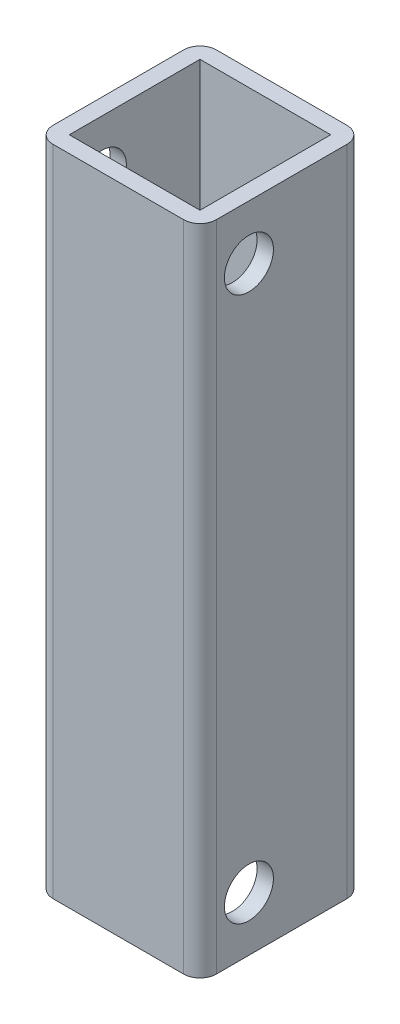
ISO-10303-21;
HEADER;
FILE_DESCRIPTION(('STEP AP214'),'2;1');
FILE_NAME('part.step','',(''),(''),'','','');
FILE_SCHEMA(('AUTOMOTIVE_DESIGN { 1 0 10303 214 1 1 1 1 }'));
ENDSEC;
DATA;
#1=APPLICATION_CONTEXT('core data for automotive mechanical design processes');
#2=APPLICATION_PROTOCOL_DEFINITION('international standard','automotive_design',2000,#1);
#3=PRODUCT_CONTEXT('',#1,'mechanical');
#4=PRODUCT('Part','Part','',(#3));
#5=PRODUCT_RELATED_PRODUCT_CATEGORY('part','',(#4));
#6=PRODUCT_DEFINITION_FORMATION('','',#4);
#7=PRODUCT_DEFINITION_CONTEXT('part definition',#1,'design');
#8=PRODUCT_DEFINITION('design','',#6,#7);
#9=PRODUCT_DEFINITION_SHAPE('','',#8);
#10=(LENGTH_UNIT() NAMED_UNIT(*) SI_UNIT(.MILLI.,.METRE.));
#11=(NAMED_UNIT(*) PLANE_ANGLE_UNIT() SI_UNIT($,.RADIAN.));
#12=(NAMED_UNIT(*) SI_UNIT($,.STERADIAN.) SOLID_ANGLE_UNIT());
#13=UNCERTAINTY_MEASURE_WITH_UNIT(LENGTH_MEASURE(1.E-05),#10,'distance_accuracy_value','');
#14=(GEOMETRIC_REPRESENTATION_CONTEXT(3) GLOBAL_UNCERTAINTY_ASSIGNED_CONTEXT((#13)) GLOBAL_UNIT_ASSIGNED_CONTEXT((#10,
#11,#12)) REPRESENTATION_CONTEXT('',''));
#15=CARTESIAN_POINT('',(0.,0.,0.));
#16=DIRECTION('',(0.,0.,1.));
#17=DIRECTION('',(1.,0.,0.));
#18=AXIS2_PLACEMENT_3D('',#15,#16,#17);
#19=CARTESIAN_POINT('',(-15.,497.934499999996,-29.1000000000432));
#20=DIRECTION('',(1.,0.,0.));
#21=DIRECTION('',(0.,0.,-1.));
#22=AXIS2_PLACEMENT_3D('',#19,#20,#21);
#23=CYLINDRICAL_SURFACE('',#22,4.50000000000003);
#24=CARTESIAN_POINT('',(12.,497.934499999996,-29.1000000000432));
#25=DIRECTION('',(1.,0.,0.));
#26=DIRECTION('',(0.,0.,-1.));
#27=AXIS2_PLACEMENT_3D('',#24,#25,#26);
#28=CIRCLE('',#27,4.50000000000003);
#29=CARTESIAN_POINT('',(12.,497.934499999996,-33.6000000000432));
#30=VERTEX_POINT('',#29);
#31=EDGE_CURVE('E140',#30,#30,#28,.F.);
#32=ORIENTED_EDGE('',*,*,#31,.T.);
#33=EDGE_LOOP('',(#32));
#34=FACE_BOUND('',#33,.T.);
#35=CARTESIAN_POINT('',(15.,497.934499999996,-29.1000000000432));
#36=DIRECTION('',(1.,0.,0.));
#37=DIRECTION('',(0.,0.,-1.));
#38=AXIS2_PLACEMENT_3D('',#35,#36,#37);
#39=CIRCLE('',#38,4.50000000000003);
#40=CARTESIAN_POINT('',(15.,497.934499999996,-33.6000000000432));
#41=VERTEX_POINT('',#40);
#42=EDGE_CURVE('E155',#41,#41,#39,.F.);
#43=ORIENTED_EDGE('',*,*,#42,.F.);
#44=EDGE_LOOP('',(#43));
#45=FACE_BOUND('',#44,.T.);
#46=ADVANCED_FACE('F17',(#34,#45),#23,.F.);
#47=CARTESIAN_POINT('',(-15.,397.934499999996,-29.1000000000331));
#48=DIRECTION('',(1.,0.,0.));
#49=DIRECTION('',(0.,0.,-1.));
#50=AXIS2_PLACEMENT_3D('',#47,#48,#49);
#51=CYLINDRICAL_SURFACE('',#50,4.50000000000003);
#52=CARTESIAN_POINT('',(12.,397.934499999996,-29.1000000000331));
#53=DIRECTION('',(1.,0.,0.));
#54=DIRECTION('',(0.,0.,-1.));
#55=AXIS2_PLACEMENT_3D('',#52,#53,#54);
#56=CIRCLE('',#55,4.50000000000003);
#57=CARTESIAN_POINT('',(12.,397.934499999996,-33.6000000000331));
#58=VERTEX_POINT('',#57);
#59=EDGE_CURVE('E126',#58,#58,#56,.F.);
#60=ORIENTED_EDGE('',*,*,#59,.T.);
#61=EDGE_LOOP('',(#60));
#62=FACE_BOUND('',#61,.T.);
#63=CARTESIAN_POINT('',(15.,397.934499999996,-29.1000000000331));
#64=DIRECTION('',(1.,0.,0.));
#65=DIRECTION('',(0.,0.,-1.));
#66=AXIS2_PLACEMENT_3D('',#63,#64,#65);
#67=CIRCLE('',#66,4.50000000000003);
#68=CARTESIAN_POINT('',(15.,397.934499999996,-33.6000000000331));
#69=VERTEX_POINT('',#68);
#70=EDGE_CURVE('E20',#69,#69,#67,.F.);
#71=ORIENTED_EDGE('',*,*,#70,.F.);
#72=EDGE_LOOP('',(#71));
#73=FACE_BOUND('',#72,.T.);
#74=ADVANCED_FACE('F197',(#62,#73),#51,.F.);
#75=CARTESIAN_POINT('',(-15.,397.934499999996,-29.1000000000331));
#76=DIRECTION('',(1.,0.,0.));
#77=DIRECTION('',(0.,0.,-1.));
#78=AXIS2_PLACEMENT_3D('',#75,#76,#77);
#79=CYLINDRICAL_SURFACE('',#78,4.50000000000003);
#80=CARTESIAN_POINT('',(-15.,397.934499999996,-29.1000000000331));
#81=DIRECTION('',(1.,0.,0.));
#82=DIRECTION('',(0.,0.,-1.));
#83=AXIS2_PLACEMENT_3D('',#80,#81,#82);
#84=CIRCLE('',#83,4.50000000000003);
#85=CARTESIAN_POINT('',(-15.,397.934499999996,-33.6000000000331));
#86=VERTEX_POINT('',#85);
#87=EDGE_CURVE('E149',#86,#86,#84,.T.);
#88=ORIENTED_EDGE('',*,*,#87,.F.);
#89=EDGE_LOOP('',(#88));
#90=FACE_BOUND('',#89,.T.);
#91=CARTESIAN_POINT('',(-12.,397.934499999996,-29.1000000000331));
#92=DIRECTION('',(1.,0.,0.));
#93=DIRECTION('',(0.,0.,-1.));
#94=AXIS2_PLACEMENT_3D('',#91,#92,#93);
#95=CIRCLE('',#94,4.50000000000003);
#96=CARTESIAN_POINT('',(-12.,397.934499999996,-33.6000000000331));
#97=VERTEX_POINT('',#96);
#98=EDGE_CURVE('E174',#97,#97,#95,.T.);
#99=ORIENTED_EDGE('',*,*,#98,.T.);
#100=EDGE_LOOP('',(#99));
#101=FACE_BOUND('',#100,.T.);
#102=ADVANCED_FACE('F199',(#90,#101),#79,.F.);
#103=CARTESIAN_POINT('',(-15.,497.934499999996,-29.1000000000432));
#104=DIRECTION('',(1.,0.,0.));
#105=DIRECTION('',(0.,0.,-1.));
#106=AXIS2_PLACEMENT_3D('',#103,#104,#105);
#107=CYLINDRICAL_SURFACE('',#106,4.50000000000003);
#108=CARTESIAN_POINT('',(-15.,497.934499999996,-29.1000000000432));
#109=DIRECTION('',(1.,0.,0.));
#110=DIRECTION('',(0.,0.,-1.));
#111=AXIS2_PLACEMENT_3D('',#108,#109,#110);
#112=CIRCLE('',#111,4.50000000000003);
#113=CARTESIAN_POINT('',(-15.,497.934499999996,-33.6000000000432));
#114=VERTEX_POINT('',#113);
#115=EDGE_CURVE('E146',#114,#114,#112,.T.);
#116=ORIENTED_EDGE('',*,*,#115,.F.);
#117=EDGE_LOOP('',(#116));
#118=FACE_BOUND('',#117,.T.);
#119=CARTESIAN_POINT('',(-12.,497.934499999996,-29.1000000000432));
#120=DIRECTION('',(1.,0.,0.));
#121=DIRECTION('',(0.,0.,-1.));
#122=AXIS2_PLACEMENT_3D('',#119,#120,#121);
#123=CIRCLE('',#122,4.50000000000003);
#124=CARTESIAN_POINT('',(-12.,497.934499999996,-33.6000000000432));
#125=VERTEX_POINT('',#124);
#126=EDGE_CURVE('E171',#125,#125,#123,.T.);
#127=ORIENTED_EDGE('',*,*,#126,.T.);
#128=EDGE_LOOP('',(#127));
#129=FACE_BOUND('',#128,.T.);
#130=ADVANCED_FACE('F206',(#118,#129),#107,.F.);
#131=CARTESIAN_POINT('',(15.,640.,-50.1201374153035));
#132=DIRECTION('',(1.,0.,0.));
#133=DIRECTION('',(0.,0.,-1.));
#134=AXIS2_PLACEMENT_3D('',#131,#132,#133);
#135=PLANE('',#134);
#136=ORIENTED_EDGE('',*,*,#42,.T.);
#137=EDGE_LOOP('',(#136));
#138=FACE_BOUND('',#137,.T.);
#139=ORIENTED_EDGE('',*,*,#70,.T.);
#140=EDGE_LOOP('',(#139));
#141=FACE_BOUND('',#140,.T.);
#142=DIRECTION('',(0.,-1.,0.));
#143=VECTOR('',#142,1.);
#144=CARTESIAN_POINT('',(15.,640.,-23.1201374153035));
#145=LINE('',#144,#143);
#146=CARTESIAN_POINT('',(15.,387.934536743125,-23.1201374153035));
#147=VERTEX_POINT('',#146);
#148=CARTESIAN_POINT('',(15.,507.9,-23.1201374153035));
#149=VERTEX_POINT('',#148);
#150=EDGE_CURVE('E129',#147,#149,#145,.F.);
#151=ORIENTED_EDGE('',*,*,#150,.F.);
#152=DIRECTION('',(0.,0.,-1.));
#153=VECTOR('',#152,1.);
#154=CARTESIAN_POINT('',(15.,387.934536743125,-15.5800237534903));
#155=LINE('',#154,#153);
#156=CARTESIAN_POINT('',(15.,387.934536743125,-47.1201374153035));
#157=VERTEX_POINT('',#156);
#158=EDGE_CURVE('E123',#157,#147,#155,.F.);
#159=ORIENTED_EDGE('',*,*,#158,.F.);
#160=DIRECTION('',(0.,-1.,0.));
#161=VECTOR('',#160,1.);
#162=CARTESIAN_POINT('',(15.,640.,-47.1201374153035));
#163=LINE('',#162,#161);
#164=CARTESIAN_POINT('',(15.,507.9,-47.1201374153035));
#165=VERTEX_POINT('',#164);
#166=EDGE_CURVE('E110',#165,#157,#163,.T.);
#167=ORIENTED_EDGE('',*,*,#166,.F.);
#168=DIRECTION('',(0.,0.,-1.));
#169=VECTOR('',#168,1.);
#170=CARTESIAN_POINT('',(15.,507.9,-15.5800237534903));
#171=LINE('',#170,#169);
#172=EDGE_CURVE('E170',#165,#149,#171,.F.);
#173=ORIENTED_EDGE('',*,*,#172,.T.);
#174=EDGE_LOOP('',(#151,#159,#167,#173));
#175=FACE_BOUND('',#174,.T.);
#176=ADVANCED_FACE('F128',(#138,#141,#175),#135,.T.);
#177=CARTESIAN_POINT('',(12.,640.,-23.1201374153035));
#178=DIRECTION('',(0.,-1.,0.));
#179=DIRECTION('',(0.,0.,-1.));
#180=AXIS2_PLACEMENT_3D('',#177,#178,#179);
#181=CYLINDRICAL_SURFACE('',#180,3.);
#182=CARTESIAN_POINT('',(12.,507.9,-23.1201374153035));
#183=DIRECTION('',(0.,-1.,0.));
#184=DIRECTION('',(0.,0.,-1.));
#185=AXIS2_PLACEMENT_3D('',#182,#183,#184);
#186=CIRCLE('',#185,3.);
#187=CARTESIAN_POINT('',(12.,507.9,-20.1201374153035));
#188=VERTEX_POINT('',#187);
#189=EDGE_CURVE('E167',#149,#188,#186,.T.);
#190=ORIENTED_EDGE('',*,*,#189,.T.);
#191=DIRECTION('',(0.,1.,0.));
#192=VECTOR('',#191,1.);
#193=CARTESIAN_POINT('',(12.,640.,-20.1201374153035));
#194=LINE('',#193,#192);
#195=CARTESIAN_POINT('',(12.,387.934536743125,-20.1201374153035));
#196=VERTEX_POINT('',#195);
#197=EDGE_CURVE('E152',#196,#188,#194,.T.);
#198=ORIENTED_EDGE('',*,*,#197,.F.);
#199=CARTESIAN_POINT('',(12.,387.934536743125,-23.1201374153035));
#200=DIRECTION('',(0.,-1.,0.));
#201=DIRECTION('',(0.,0.,-1.));
#202=AXIS2_PLACEMENT_3D('',#199,#200,#201);
#203=CIRCLE('',#202,3.);
#204=EDGE_CURVE('E131',#147,#196,#203,.T.);
#205=ORIENTED_EDGE('',*,*,#204,.F.);
#206=ORIENTED_EDGE('',*,*,#150,.T.);
#207=EDGE_LOOP('',(#190,#198,#205,#206));
#208=FACE_BOUND('',#207,.T.);
#209=ADVANCED_FACE('F256',(#208),#181,.T.);
#210=CARTESIAN_POINT('',(15.,640.,-20.1201374153035));
#211=DIRECTION('',(0.,0.,1.));
#212=DIRECTION('',(1.,0.,0.));
#213=AXIS2_PLACEMENT_3D('',#210,#211,#212);
#214=PLANE('',#213);
#215=ORIENTED_EDGE('',*,*,#197,.T.);
#216=DIRECTION('',(1.,0.,0.));
#217=VECTOR('',#216,1.);
#218=CARTESIAN_POINT('',(-2.71782596428238E-12,507.9,-20.1201374153035));
#219=LINE('',#218,#217);
#220=CARTESIAN_POINT('',(-12.,507.9,-20.1201374153035));
#221=VERTEX_POINT('',#220);
#222=EDGE_CURVE('E166',#188,#221,#219,.F.);
#223=ORIENTED_EDGE('',*,*,#222,.T.);
#224=DIRECTION('',(0.,-1.,0.));
#225=VECTOR('',#224,1.);
#226=CARTESIAN_POINT('',(-12.,640.,-20.1201374153035));
#227=LINE('',#226,#225);
#228=CARTESIAN_POINT('',(-12.,387.934536743125,-20.1201374153035));
#229=VERTEX_POINT('',#228);
#230=EDGE_CURVE('E150',#229,#221,#227,.F.);
#231=ORIENTED_EDGE('',*,*,#230,.F.);
#232=DIRECTION('',(1.,0.,0.));
#233=VECTOR('',#232,1.);
#234=CARTESIAN_POINT('',(-2.71782596428238E-12,387.934536743125,-20.1201374153035));
#235=LINE('',#234,#233);
#236=EDGE_CURVE('E133',#196,#229,#235,.F.);
#237=ORIENTED_EDGE('',*,*,#236,.F.);
#238=EDGE_LOOP('',(#215,#223,#231,#237));
#239=FACE_BOUND('',#238,.T.);
#240=ADVANCED_FACE('F252',(#239),#214,.T.);
#241=CARTESIAN_POINT('',(-12.,640.,-23.1201374153035));
#242=DIRECTION('',(0.,-1.,0.));
#243=DIRECTION('',(0.,0.,-1.));
#244=AXIS2_PLACEMENT_3D('',#241,#242,#243);
#245=CYLINDRICAL_SURFACE('',#244,3.);
#246=CARTESIAN_POINT('',(-12.,507.9,-23.1201374153035));
#247=DIRECTION('',(0.,-1.,0.));
#248=DIRECTION('',(0.,0.,-1.));
#249=AXIS2_PLACEMENT_3D('',#246,#247,#248);
#250=CIRCLE('',#249,3.);
#251=CARTESIAN_POINT('',(-15.,507.9,-23.1201374153035));
#252=VERTEX_POINT('',#251);
#253=EDGE_CURVE('E163',#221,#252,#250,.T.);
#254=ORIENTED_EDGE('',*,*,#253,.T.);
#255=DIRECTION('',(0.,1.,0.));
#256=VECTOR('',#255,1.);
#257=CARTESIAN_POINT('',(-15.,640.,-23.1201374153035));
#258=LINE('',#257,#256);
#259=CARTESIAN_POINT('',(-15.,387.934536743125,-23.1201374153035));
#260=VERTEX_POINT('',#259);
#261=EDGE_CURVE('E147',#260,#252,#258,.T.);
#262=ORIENTED_EDGE('',*,*,#261,.F.);
#263=CARTESIAN_POINT('',(-12.,387.934536743125,-23.1201374153035));
#264=DIRECTION('',(0.,-1.,0.));
#265=DIRECTION('',(0.,0.,-1.));
#266=AXIS2_PLACEMENT_3D('',#263,#264,#265);
#267=CIRCLE('',#266,3.);
#268=EDGE_CURVE('E181',#229,#260,#267,.T.);
#269=ORIENTED_EDGE('',*,*,#268,.F.);
#270=ORIENTED_EDGE('',*,*,#230,.T.);
#271=EDGE_LOOP('',(#254,#262,#269,#270));
#272=FACE_BOUND('',#271,.T.);
#273=ADVANCED_FACE('F248',(#272),#245,.T.);
#274=CARTESIAN_POINT('',(-15.,640.,-20.1201374153035));
#275=DIRECTION('',(-1.,0.,0.));
#276=DIRECTION('',(0.,0.,1.));
#277=AXIS2_PLACEMENT_3D('',#274,#275,#276);
#278=PLANE('',#277);
#279=ORIENTED_EDGE('',*,*,#115,.T.);
#280=EDGE_LOOP('',(#279));
#281=FACE_BOUND('',#280,.T.);
#282=ORIENTED_EDGE('',*,*,#87,.T.);
#283=EDGE_LOOP('',(#282));
#284=FACE_BOUND('',#283,.T.);
#285=ORIENTED_EDGE('',*,*,#261,.T.);
#286=DIRECTION('',(0.,0.,-1.));
#287=VECTOR('',#286,1.);
#288=CARTESIAN_POINT('',(-15.,507.9,-15.5800237534903));
#289=LINE('',#288,#287);
#290=CARTESIAN_POINT('',(-15.,507.9,-47.1201374153035));
#291=VERTEX_POINT('',#290);
#292=EDGE_CURVE('E162',#252,#291,#289,.T.);
#293=ORIENTED_EDGE('',*,*,#292,.T.);
#294=DIRECTION('',(0.,-1.,0.));
#295=VECTOR('',#294,1.);
#296=CARTESIAN_POINT('',(-15.,640.,-47.1201374153035));
#297=LINE('',#296,#295);
#298=CARTESIAN_POINT('',(-15.,387.934536743125,-47.1201374153035));
#299=VERTEX_POINT('',#298);
#300=EDGE_CURVE('E144',#299,#291,#297,.F.);
#301=ORIENTED_EDGE('',*,*,#300,.F.);
#302=DIRECTION('',(0.,0.,-1.));
#303=VECTOR('',#302,1.);
#304=CARTESIAN_POINT('',(-15.,387.934536743125,-15.5800237534903));
#305=LINE('',#304,#303);
#306=EDGE_CURVE('E180',#260,#299,#305,.T.);
#307=ORIENTED_EDGE('',*,*,#306,.F.);
#308=EDGE_LOOP('',(#285,#293,#301,#307));
#309=FACE_BOUND('',#308,.T.);
#310=ADVANCED_FACE('F244',(#281,#284,#309),#278,.T.);
#311=CARTESIAN_POINT('',(-12.,640.,-47.1201374153035));
#312=DIRECTION('',(0.,-1.,0.));
#313=DIRECTION('',(0.,0.,-1.));
#314=AXIS2_PLACEMENT_3D('',#311,#312,#313);
#315=CYLINDRICAL_SURFACE('',#314,3.);
#316=CARTESIAN_POINT('',(-12.,507.9,-47.1201374153035));
#317=DIRECTION('',(0.,-1.,0.));
#318=DIRECTION('',(0.,0.,-1.));
#319=AXIS2_PLACEMENT_3D('',#316,#317,#318);
#320=CIRCLE('',#319,3.);
#321=CARTESIAN_POINT('',(-12.,507.9,-50.1201374153035));
#322=VERTEX_POINT('',#321);
#323=EDGE_CURVE('E159',#291,#322,#320,.T.);
#324=ORIENTED_EDGE('',*,*,#323,.T.);
#325=DIRECTION('',(0.,1.,0.));
#326=VECTOR('',#325,1.);
#327=CARTESIAN_POINT('',(-12.,640.,-50.1201374153035));
#328=LINE('',#327,#326);
#329=CARTESIAN_POINT('',(-12.,387.934536743125,-50.1201374153035));
#330=VERTEX_POINT('',#329);
#331=EDGE_CURVE('E141',#330,#322,#328,.T.);
#332=ORIENTED_EDGE('',*,*,#331,.F.);
#333=CARTESIAN_POINT('',(-12.,387.934536743125,-47.1201374153035));
#334=DIRECTION('',(0.,-1.,0.));
#335=DIRECTION('',(0.,0.,-1.));
#336=AXIS2_PLACEMENT_3D('',#333,#334,#335);
#337=CIRCLE('',#336,3.);
#338=EDGE_CURVE('E178',#299,#330,#337,.T.);
#339=ORIENTED_EDGE('',*,*,#338,.F.);
#340=ORIENTED_EDGE('',*,*,#300,.T.);
#341=EDGE_LOOP('',(#324,#332,#339,#340));
#342=FACE_BOUND('',#341,.T.);
#343=ADVANCED_FACE('F241',(#342),#315,.T.);
#344=CARTESIAN_POINT('',(-15.,640.,-50.1201374153035));
#345=DIRECTION('',(0.,0.,-1.));
#346=DIRECTION('',(-1.,0.,0.));
#347=AXIS2_PLACEMENT_3D('',#344,#345,#346);
#348=PLANE('',#347);
#349=ORIENTED_EDGE('',*,*,#331,.T.);
#350=DIRECTION('',(1.,0.,0.));
#351=VECTOR('',#350,1.);
#352=CARTESIAN_POINT('',(-2.71782596428238E-12,507.9,-50.1201374153035));
#353=LINE('',#352,#351);
#354=CARTESIAN_POINT('',(12.,507.9,-50.1201374153035));
#355=VERTEX_POINT('',#354);
#356=EDGE_CURVE('E158',#322,#355,#353,.T.);
#357=ORIENTED_EDGE('',*,*,#356,.T.);
#358=DIRECTION('',(0.,-1.,0.));
#359=VECTOR('',#358,1.);
#360=CARTESIAN_POINT('',(12.,640.,-50.1201374153035));
#361=LINE('',#360,#359);
#362=CARTESIAN_POINT('',(12.,387.934536743125,-50.1201374153035));
#363=VERTEX_POINT('',#362);
#364=EDGE_CURVE('E103',#363,#355,#361,.F.);
#365=ORIENTED_EDGE('',*,*,#364,.F.);
#366=DIRECTION('',(1.,0.,0.));
#367=VECTOR('',#366,1.);
#368=CARTESIAN_POINT('',(-2.71782596428238E-12,387.934536743125,-50.1201374153035));
#369=LINE('',#368,#367);
#370=EDGE_CURVE('E125',#330,#363,#369,.T.);
#371=ORIENTED_EDGE('',*,*,#370,.F.);
#372=EDGE_LOOP('',(#349,#357,#365,#371));
#373=FACE_BOUND('',#372,.T.);
#374=ADVANCED_FACE('F238',(#373),#348,.T.);
#375=CARTESIAN_POINT('',(12.,640.,-47.1201374153035));
#376=DIRECTION('',(0.,-1.,0.));
#377=DIRECTION('',(0.,0.,-1.));
#378=AXIS2_PLACEMENT_3D('',#375,#376,#377);
#379=CYLINDRICAL_SURFACE('',#378,3.);
#380=CARTESIAN_POINT('',(12.,507.9,-47.1201374153035));
#381=DIRECTION('',(0.,-1.,0.));
#382=DIRECTION('',(0.,0.,-1.));
#383=AXIS2_PLACEMENT_3D('',#380,#381,#382);
#384=CIRCLE('',#383,3.);
#385=EDGE_CURVE('E115',#355,#165,#384,.T.);
#386=ORIENTED_EDGE('',*,*,#385,.T.);
#387=ORIENTED_EDGE('',*,*,#166,.T.);
#388=CARTESIAN_POINT('',(12.,387.934536743125,-47.1201374153035));
#389=DIRECTION('',(0.,-1.,0.));
#390=DIRECTION('',(0.,0.,-1.));
#391=AXIS2_PLACEMENT_3D('',#388,#389,#390);
#392=CIRCLE('',#391,3.);
#393=EDGE_CURVE('E113',#363,#157,#392,.T.);
#394=ORIENTED_EDGE('',*,*,#393,.F.);
#395=ORIENTED_EDGE('',*,*,#364,.T.);
#396=EDGE_LOOP('',(#386,#387,#394,#395));
#397=FACE_BOUND('',#396,.T.);
#398=ADVANCED_FACE('F112',(#397),#379,.T.);
#399=CARTESIAN_POINT('',(-12.,387.934536743125,-23.1201374153035));
#400=DIRECTION('',(0.,0.,1.));
#401=DIRECTION('',(1.,0.,0.));
#402=AXIS2_PLACEMENT_3D('',#399,#400,#401);
#403=PLANE('',#402);
#404=DIRECTION('',(0.,1.,0.));
#405=VECTOR('',#404,1.);
#406=CARTESIAN_POINT('',(12.,387.934536743125,-23.1201374153035));
#407=LINE('',#406,#405);
#408=CARTESIAN_POINT('',(12.,507.9,-23.1201374153035));
#409=VERTEX_POINT('',#408);
#410=CARTESIAN_POINT('',(12.,387.934536743125,-23.1201374153035));
#411=VERTEX_POINT('',#410);
#412=EDGE_CURVE('E119',#409,#411,#407,.F.);
#413=ORIENTED_EDGE('',*,*,#412,.T.);
#414=DIRECTION('',(1.,0.,0.));
#415=VECTOR('',#414,1.);
#416=CARTESIAN_POINT('',(-2.71782596428238E-12,387.934536743125,-23.1201374153035));
#417=LINE('',#416,#415);
#418=CARTESIAN_POINT('',(-12.,387.934536743125,-23.1201374153035));
#419=VERTEX_POINT('',#418);
#420=EDGE_CURVE('E280',#419,#411,#417,.T.);
#421=ORIENTED_EDGE('',*,*,#420,.F.);
#422=DIRECTION('',(0.,1.,0.));
#423=VECTOR('',#422,1.);
#424=CARTESIAN_POINT('',(-12.,387.934536743125,-23.1201374153035));
#425=LINE('',#424,#423);
#426=CARTESIAN_POINT('',(-12.,507.9,-23.1201374153035));
#427=VERTEX_POINT('',#426);
#428=EDGE_CURVE('E177',#419,#427,#425,.T.);
#429=ORIENTED_EDGE('',*,*,#428,.T.);
#430=DIRECTION('',(1.,0.,0.));
#431=VECTOR('',#430,1.);
#432=CARTESIAN_POINT('',(-2.71782596428238E-12,507.9,-23.1201374153035));
#433=LINE('',#432,#431);
#434=EDGE_CURVE('E315',#427,#409,#433,.T.);
#435=ORIENTED_EDGE('',*,*,#434,.T.);
#436=EDGE_LOOP('',(#413,#421,#429,#435));
#437=FACE_BOUND('',#436,.T.);
#438=ADVANCED_FACE('F231',(#437),#403,.F.);
#439=CARTESIAN_POINT('',(12.,387.934536743125,-23.1201374153035));
#440=DIRECTION('',(1.,0.,0.));
#441=DIRECTION('',(0.,0.,-1.));
#442=AXIS2_PLACEMENT_3D('',#439,#440,#441);
#443=PLANE('',#442);
#444=ORIENTED_EDGE('',*,*,#59,.F.);
#445=EDGE_LOOP('',(#444));
#446=FACE_BOUND('',#445,.T.);
#447=ORIENTED_EDGE('',*,*,#31,.F.);
#448=EDGE_LOOP('',(#447));
#449=FACE_BOUND('',#448,.T.);
#450=DIRECTION('',(0.,1.,0.));
#451=VECTOR('',#450,1.);
#452=CARTESIAN_POINT('',(12.,387.934536743125,-47.1201374153035));
#453=LINE('',#452,#451);
#454=CARTESIAN_POINT('',(12.,507.9,-47.1201374153035));
#455=VERTEX_POINT('',#454);
#456=CARTESIAN_POINT('',(12.,387.934536743125,-47.1201374153035));
#457=VERTEX_POINT('',#456);
#458=EDGE_CURVE('E317',#455,#457,#453,.F.);
#459=ORIENTED_EDGE('',*,*,#458,.T.);
#460=DIRECTION('',(0.,0.,-1.));
#461=VECTOR('',#460,1.);
#462=CARTESIAN_POINT('',(12.,387.934536743125,-15.5800237534903));
#463=LINE('',#462,#461);
#464=EDGE_CURVE('E283',#411,#457,#463,.T.);
#465=ORIENTED_EDGE('',*,*,#464,.F.);
#466=ORIENTED_EDGE('',*,*,#412,.F.);
#467=DIRECTION('',(0.,0.,-1.));
#468=VECTOR('',#467,1.);
#469=CARTESIAN_POINT('',(12.,507.9,-15.5800237534903));
#470=LINE('',#469,#468);
#471=EDGE_CURVE('E157',#409,#455,#470,.T.);
#472=ORIENTED_EDGE('',*,*,#471,.T.);
#473=EDGE_LOOP('',(#459,#465,#466,#472));
#474=FACE_BOUND('',#473,.T.);
#475=ADVANCED_FACE('F227',(#446,#449,#474),#443,.F.);
#476=CARTESIAN_POINT('',(-2.71782596428238E-12,387.934536743125,-15.5800237534903));
#477=DIRECTION('',(0.,-1.,0.));
#478=DIRECTION('',(0.,0.,-1.));
#479=AXIS2_PLACEMENT_3D('',#476,#477,#478);
#480=PLANE('',#479);
#481=DIRECTION('',(-1.,0.,0.));
#482=VECTOR('',#481,1.);
#483=CARTESIAN_POINT('',(12.,387.934536743125,-47.1201374153035));
#484=LINE('',#483,#482);
#485=CARTESIAN_POINT('',(-12.,387.934536743125,-47.1201374153035));
#486=VERTEX_POINT('',#485);
#487=EDGE_CURVE('E282',#457,#486,#484,.T.);
#488=ORIENTED_EDGE('',*,*,#487,.T.);
#489=DIRECTION('',(0.,0.,1.));
#490=VECTOR('',#489,1.);
#491=CARTESIAN_POINT('',(-12.,387.934536743125,-47.1201374153035));
#492=LINE('',#491,#490);
#493=EDGE_CURVE('E276',#486,#419,#492,.T.);
#494=ORIENTED_EDGE('',*,*,#493,.T.);
#495=ORIENTED_EDGE('',*,*,#420,.T.);
#496=ORIENTED_EDGE('',*,*,#464,.T.);
#497=EDGE_LOOP('',(#488,#494,#495,#496));
#498=FACE_BOUND('',#497,.T.);
#499=ORIENTED_EDGE('',*,*,#338,.T.);
#500=ORIENTED_EDGE('',*,*,#370,.T.);
#501=ORIENTED_EDGE('',*,*,#393,.T.);
#502=ORIENTED_EDGE('',*,*,#158,.T.);
#503=ORIENTED_EDGE('',*,*,#204,.T.);
#504=ORIENTED_EDGE('',*,*,#236,.T.);
#505=ORIENTED_EDGE('',*,*,#268,.T.);
#506=ORIENTED_EDGE('',*,*,#306,.T.);
#507=EDGE_LOOP('',(#499,#500,#501,#502,#503,#504,#505,#506));
#508=FACE_BOUND('',#507,.T.);
#509=ADVANCED_FACE('F122',(#498,#508),#480,.T.);
#510=CARTESIAN_POINT('',(-12.,387.934536743125,-47.1201374153035));
#511=DIRECTION('',(-1.,0.,0.));
#512=DIRECTION('',(0.,0.,1.));
#513=AXIS2_PLACEMENT_3D('',#510,#511,#512);
#514=PLANE('',#513);
#515=ORIENTED_EDGE('',*,*,#126,.F.);
#516=EDGE_LOOP('',(#515));
#517=FACE_BOUND('',#516,.T.);
#518=ORIENTED_EDGE('',*,*,#98,.F.);
#519=EDGE_LOOP('',(#518));
#520=FACE_BOUND('',#519,.T.);
#521=ORIENTED_EDGE('',*,*,#428,.F.);
#522=ORIENTED_EDGE('',*,*,#493,.F.);
#523=DIRECTION('',(0.,1.,0.));
#524=VECTOR('',#523,1.);
#525=CARTESIAN_POINT('',(-12.,387.934536743125,-47.1201374153035));
#526=LINE('',#525,#524);
#527=CARTESIAN_POINT('',(-12.,507.9,-47.1201374153035));
#528=VERTEX_POINT('',#527);
#529=EDGE_CURVE('E26',#486,#528,#526,.T.);
#530=ORIENTED_EDGE('',*,*,#529,.T.);
#531=DIRECTION('',(0.,0.,-1.));
#532=VECTOR('',#531,1.);
#533=CARTESIAN_POINT('',(-12.,507.9,-15.5800237534903));
#534=LINE('',#533,#532);
#535=EDGE_CURVE('E34',#528,#427,#534,.F.);
#536=ORIENTED_EDGE('',*,*,#535,.T.);
#537=EDGE_LOOP('',(#521,#522,#530,#536));
#538=FACE_BOUND('',#537,.T.);
#539=ADVANCED_FACE('F218',(#517,#520,#538),#514,.F.);
#540=CARTESIAN_POINT('',(-2.71782596428238E-12,507.9,-15.5800237534903));
#541=DIRECTION('',(0.,-1.,0.));
#542=DIRECTION('',(0.,0.,-1.));
#543=AXIS2_PLACEMENT_3D('',#540,#541,#542);
#544=PLANE('',#543);
#545=ORIENTED_EDGE('',*,*,#535,.F.);
#546=DIRECTION('',(-1.,0.,0.));
#547=VECTOR('',#546,1.);
#548=CARTESIAN_POINT('',(12.,507.9,-47.1201374153035));
#549=LINE('',#548,#547);
#550=EDGE_CURVE('E11',#528,#455,#549,.F.);
#551=ORIENTED_EDGE('',*,*,#550,.T.);
#552=ORIENTED_EDGE('',*,*,#471,.F.);
#553=ORIENTED_EDGE('',*,*,#434,.F.);
#554=EDGE_LOOP('',(#545,#551,#552,#553));
#555=FACE_BOUND('',#554,.T.);
#556=ORIENTED_EDGE('',*,*,#356,.F.);
#557=ORIENTED_EDGE('',*,*,#323,.F.);
#558=ORIENTED_EDGE('',*,*,#292,.F.);
#559=ORIENTED_EDGE('',*,*,#253,.F.);
#560=ORIENTED_EDGE('',*,*,#222,.F.);
#561=ORIENTED_EDGE('',*,*,#189,.F.);
#562=ORIENTED_EDGE('',*,*,#172,.F.);
#563=ORIENTED_EDGE('',*,*,#385,.F.);
#564=EDGE_LOOP('',(#556,#557,#558,#559,#560,#561,#562,#563));
#565=FACE_BOUND('',#564,.T.);
#566=ADVANCED_FACE('F212',(#555,#565),#544,.F.);
#567=CARTESIAN_POINT('',(12.,387.934536743125,-47.1201374153035));
#568=DIRECTION('',(0.,0.,-1.));
#569=DIRECTION('',(-1.,0.,0.));
#570=AXIS2_PLACEMENT_3D('',#567,#568,#569);
#571=PLANE('',#570);
#572=ORIENTED_EDGE('',*,*,#529,.F.);
#573=ORIENTED_EDGE('',*,*,#487,.F.);
#574=ORIENTED_EDGE('',*,*,#458,.F.);
#575=ORIENTED_EDGE('',*,*,#550,.F.);
#576=EDGE_LOOP('',(#572,#573,#574,#575));
#577=FACE_BOUND('',#576,.T.);
#578=ADVANCED_FACE('F210',(#577),#571,.F.);
#579=CLOSED_SHELL('',(#46,#74,#102,#130,#176,#209,#240,#273,#310,#343,#374,#398,#438,#475,#509,
#539,#566,#578));
#580=MANIFOLD_SOLID_BREP('B1',#579);
#581=ADVANCED_BREP_SHAPE_REPRESENTATION('',(#18,#580),#14);
#582=SHAPE_DEFINITION_REPRESENTATION(#9,#581);
ENDSEC;
END-ISO-10303-21;
